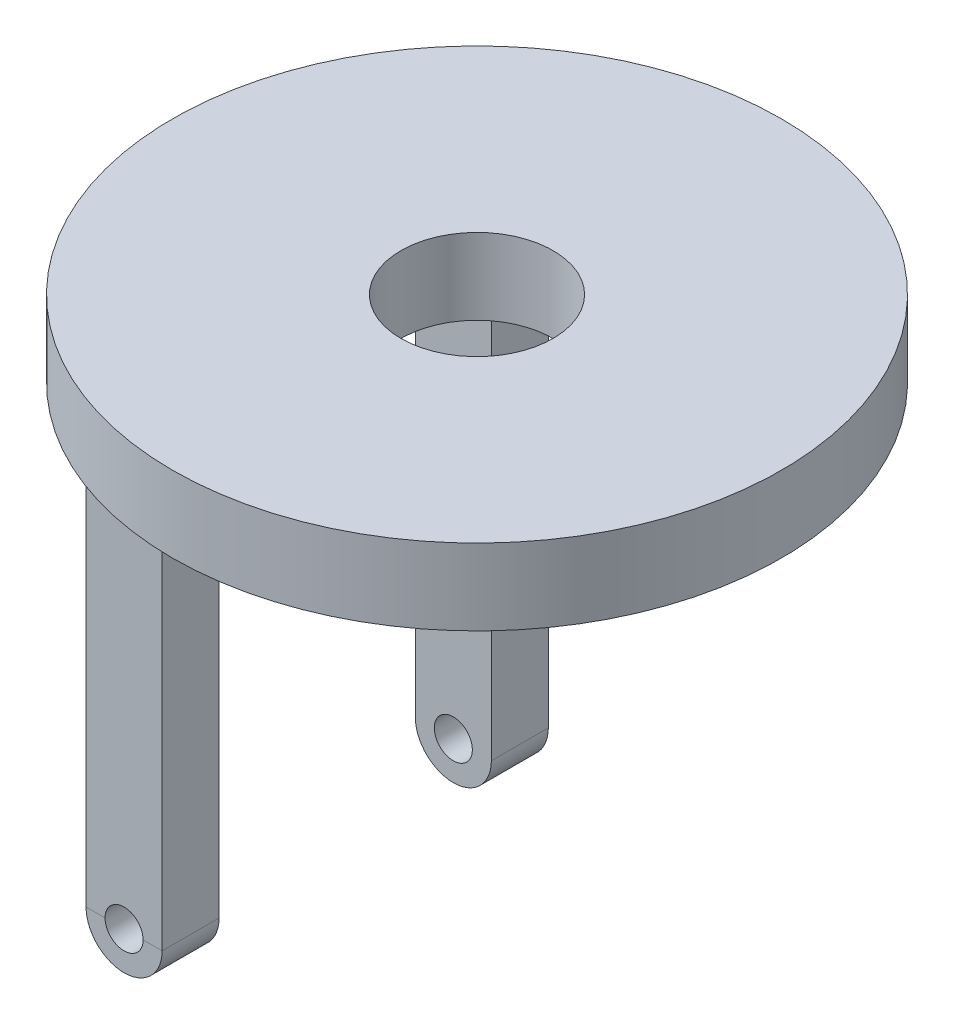
ISO-10303-21;
HEADER;
FILE_DESCRIPTION(('STEP AP214'),'2;1');
FILE_NAME('part.step','',(''),(''),'','','');
FILE_SCHEMA(('AUTOMOTIVE_DESIGN { 1 0 10303 214 1 1 1 1 }'));
ENDSEC;
DATA;
#1=APPLICATION_CONTEXT('core data for automotive mechanical design processes');
#2=APPLICATION_PROTOCOL_DEFINITION('international standard','automotive_design',2000,#1);
#3=PRODUCT_CONTEXT('',#1,'mechanical');
#4=PRODUCT('Part','Part','',(#3));
#5=PRODUCT_RELATED_PRODUCT_CATEGORY('part','',(#4));
#6=PRODUCT_DEFINITION_FORMATION('','',#4);
#7=PRODUCT_DEFINITION_CONTEXT('part definition',#1,'design');
#8=PRODUCT_DEFINITION('design','',#6,#7);
#9=PRODUCT_DEFINITION_SHAPE('','',#8);
#10=(LENGTH_UNIT() NAMED_UNIT(*) SI_UNIT(.MILLI.,.METRE.));
#11=(NAMED_UNIT(*) PLANE_ANGLE_UNIT() SI_UNIT($,.RADIAN.));
#12=(NAMED_UNIT(*) SI_UNIT($,.STERADIAN.) SOLID_ANGLE_UNIT());
#13=UNCERTAINTY_MEASURE_WITH_UNIT(LENGTH_MEASURE(1.E-05),#10,'distance_accuracy_value','');
#14=(GEOMETRIC_REPRESENTATION_CONTEXT(3) GLOBAL_UNCERTAINTY_ASSIGNED_CONTEXT((#13)) GLOBAL_UNIT_ASSIGNED_CONTEXT((#10,
#11,#12)) REPRESENTATION_CONTEXT('',''));
#15=CARTESIAN_POINT('',(0.,0.,0.));
#16=DIRECTION('',(0.,0.,1.));
#17=DIRECTION('',(1.,0.,0.));
#18=AXIS2_PLACEMENT_3D('',#15,#16,#17);
#19=CARTESIAN_POINT('',(-10.5,-16.25,-12.6842719099992));
#20=DIRECTION('',(0.,0.,1.));
#21=DIRECTION('',(1.,0.,0.));
#22=AXIS2_PLACEMENT_3D('',#19,#20,#21);
#23=PLANE('',#22);
#24=CARTESIAN_POINT('',(-11.75,-30.,-12.6885775404495));
#25=DIRECTION('',(-0.999999992847485,0.0001196036362698,0.));
#26=VECTOR('',#25,1.);
#27=LINE('',#24,#26);
#28=CARTESIAN_POINT('',(-11.75,-30.,-12.6865784977404));
#29=VERTEX_POINT('',#28);
#30=CARTESIAN_POINT('',(-13.0000000055106,-29.9998504954527,-12.6865697759956));
#31=VERTEX_POINT('',#30);
#32=EDGE_CURVE('E128',#29,#31,#27,.T.);
#33=ORIENTED_EDGE('',*,*,#32,.F.);
#34=CARTESIAN_POINT('',(-10.5,-30.,-12.6842719099992));
#35=DIRECTION('',(0.,0.,1.));
#36=DIRECTION('',(1.,0.,0.));
#37=AXIS2_PLACEMENT_3D('',#34,#35,#36);
#38=CIRCLE('',#37,1.25);
#39=CARTESIAN_POINT('',(-9.25,-30.,-12.6865784977404));
#40=VERTEX_POINT('',#39);
#41=EDGE_CURVE('E122',#29,#40,#38,.T.);
#42=ORIENTED_EDGE('',*,*,#41,.T.);
#43=CARTESIAN_POINT('',(-7.99999999254963,-30.0001495045472,-12.6885775404495));
#44=DIRECTION('',(-0.999999992847485,0.000119603636192084,0.));
#45=VECTOR('',#44,1.);
#46=LINE('',#43,#45);
#47=CARTESIAN_POINT('',(-7.99999999573109,-30.0001495045469,-12.6865697759956));
#48=VERTEX_POINT('',#47);
#49=EDGE_CURVE('E120',#48,#40,#46,.T.);
#50=ORIENTED_EDGE('',*,*,#49,.F.);
#51=CARTESIAN_POINT('',(-10.5,-30.,-12.6842719099992));
#52=DIRECTION('',(0.,0.,1.));
#53=DIRECTION('',(1.,0.,0.));
#54=AXIS2_PLACEMENT_3D('',#51,#52,#53);
#55=CIRCLE('',#54,2.5);
#56=EDGE_CURVE('E110',#31,#48,#55,.T.);
#57=ORIENTED_EDGE('',*,*,#56,.F.);
#58=EDGE_LOOP('',(#33,#42,#50,#57));
#59=FACE_BOUND('',#58,.T.);
#60=ADVANCED_FACE('F17',(#59),#23,.F.);
#61=CARTESIAN_POINT('',(-10.5,-16.25,12.6842719099992));
#62=DIRECTION('',(0.,0.,-1.));
#63=DIRECTION('',(-1.,0.,0.));
#64=AXIS2_PLACEMENT_3D('',#61,#62,#63);
#65=PLANE('',#64);
#66=CARTESIAN_POINT('',(-13.0000000074504,-30.0001495045473,12.6885775404495));
#67=DIRECTION('',(0.999999992847485,0.000119603636272574,0.));
#68=VECTOR('',#67,1.);
#69=LINE('',#66,#68);
#70=CARTESIAN_POINT('',(-13.0000000053452,-30.0001495045471,12.6864793282527));
#71=VERTEX_POINT('',#70);
#72=CARTESIAN_POINT('',(-11.75,-30.,12.6864247252243));
#73=VERTEX_POINT('',#72);
#74=EDGE_CURVE('E118',#71,#73,#69,.T.);
#75=ORIENTED_EDGE('',*,*,#74,.F.);
#76=CARTESIAN_POINT('',(-10.5,-30.,12.6842719099992));
#77=DIRECTION('',(0.,0.,-1.));
#78=DIRECTION('',(-1.,0.,0.));
#79=AXIS2_PLACEMENT_3D('',#76,#77,#78);
#80=CIRCLE('',#79,2.5);
#81=CARTESIAN_POINT('',(-7.99999999465044,-29.999850495453,12.6865697759955));
#82=VERTEX_POINT('',#81);
#83=EDGE_CURVE('E165',#82,#71,#80,.T.);
#84=ORIENTED_EDGE('',*,*,#83,.F.);
#85=CARTESIAN_POINT('',(-9.25,-30.,12.6885775404495));
#86=DIRECTION('',(0.999999992847485,0.000119603636069959,0.));
#87=VECTOR('',#86,1.);
#88=LINE('',#85,#87);
#89=CARTESIAN_POINT('',(-9.25,-30.,12.6864247252243));
#90=VERTEX_POINT('',#89);
#91=EDGE_CURVE('E94',#90,#82,#88,.T.);
#92=ORIENTED_EDGE('',*,*,#91,.F.);
#93=CARTESIAN_POINT('',(-10.5,-30.,12.6842719099992));
#94=DIRECTION('',(0.,0.,-1.));
#95=DIRECTION('',(-1.,0.,0.));
#96=AXIS2_PLACEMENT_3D('',#93,#94,#95);
#97=CIRCLE('',#96,1.25);
#98=EDGE_CURVE('E169',#90,#73,#97,.T.);
#99=ORIENTED_EDGE('',*,*,#98,.T.);
#100=EDGE_LOOP('',(#75,#84,#92,#99));
#101=FACE_BOUND('',#100,.T.);
#102=ADVANCED_FACE('F182',(#101),#65,.F.);
#103=CARTESIAN_POINT('',(-10.5,-30.,-12.6842719099992));
#104=DIRECTION('',(0.,0.,1.));
#105=DIRECTION('',(1.,0.,0.));
#106=AXIS2_PLACEMENT_3D('',#103,#104,#105);
#107=CYLINDRICAL_SURFACE('',#106,2.5);
#108=CARTESIAN_POINT('',(-10.5,-30.,-8.94427190999915));
#109=DIRECTION('',(0.,0.,1.));
#110=DIRECTION('',(1.,0.,0.));
#111=AXIS2_PLACEMENT_3D('',#108,#109,#110);
#112=CIRCLE('',#111,2.5);
#113=CARTESIAN_POINT('',(-13.,-30.,-8.94427190999915));
#114=VERTEX_POINT('',#113);
#115=CARTESIAN_POINT('',(-8.,-30.,-8.94427190999915));
#116=VERTEX_POINT('',#115);
#117=EDGE_CURVE('E159',#114,#116,#112,.T.);
#118=ORIENTED_EDGE('',*,*,#117,.F.);
#119=DIRECTION('',(0.,-3.99529765152787E-05,0.99999999920188));
#120=VECTOR('',#119,1.);
#121=CARTESIAN_POINT('',(-13.,-29.9998504954527,-12.6862846514323));
#122=LINE('',#121,#120);
#123=EDGE_CURVE('E114',#31,#114,#122,.T.);
#124=ORIENTED_EDGE('',*,*,#123,.F.);
#125=ORIENTED_EDGE('',*,*,#56,.T.);
#126=DIRECTION('',(0.,-3.99529764893174E-05,-0.99999999920188));
#127=VECTOR('',#126,1.);
#128=CARTESIAN_POINT('',(-8.,-30.,-8.94427190999915));
#129=LINE('',#128,#127);
#130=EDGE_CURVE('E85',#116,#48,#129,.T.);
#131=ORIENTED_EDGE('',*,*,#130,.F.);
#132=EDGE_LOOP('',(#118,#124,#125,#131));
#133=FACE_BOUND('',#132,.T.);
#134=ADVANCED_FACE('F112',(#133),#107,.T.);
#135=CARTESIAN_POINT('',(-8.,-30.,-10.8164247252243));
#136=DIRECTION('',(1.,0.,0.));
#137=DIRECTION('',(0.,0.,-1.));
#138=AXIS2_PLACEMENT_3D('',#135,#136,#137);
#139=PLANE('',#138);
#140=ORIENTED_EDGE('',*,*,#130,.T.);
#141=DIRECTION('',(0.,1.,0.));
#142=VECTOR('',#141,1.);
#143=CARTESIAN_POINT('',(-8.,-30.,-12.6885775404495));
#144=LINE('',#143,#142);
#145=CARTESIAN_POINT('',(-8.,-1.,-12.6885775404495));
#146=VERTEX_POINT('',#145);
#147=EDGE_CURVE('E134',#146,#48,#144,.F.);
#148=ORIENTED_EDGE('',*,*,#147,.F.);
#149=DIRECTION('',(0.,0.,-1.));
#150=VECTOR('',#149,1.);
#151=CARTESIAN_POINT('',(-8.,-1.,0.));
#152=LINE('',#151,#150);
#153=CARTESIAN_POINT('',(-8.,-1.,-8.94427190999916));
#154=VERTEX_POINT('',#153);
#155=EDGE_CURVE('E233',#154,#146,#152,.T.);
#156=ORIENTED_EDGE('',*,*,#155,.F.);
#157=DIRECTION('',(0.,1.,0.));
#158=VECTOR('',#157,1.);
#159=CARTESIAN_POINT('',(-8.,-30.,-8.94427190999915));
#160=LINE('',#159,#158);
#161=EDGE_CURVE('E137',#116,#154,#160,.T.);
#162=ORIENTED_EDGE('',*,*,#161,.F.);
#163=EDGE_LOOP('',(#140,#148,#156,#162));
#164=FACE_BOUND('',#163,.T.);
#165=ADVANCED_FACE('F133',(#164),#139,.T.);
#166=CARTESIAN_POINT('',(-10.5,-30.,-37.3157280900008));
#167=DIRECTION('',(0.,0.,1.));
#168=DIRECTION('',(1.,0.,0.));
#169=AXIS2_PLACEMENT_3D('',#166,#167,#168);
#170=CYLINDRICAL_SURFACE('',#169,1.25);
#171=ORIENTED_EDGE('',*,*,#41,.F.);
#172=CARTESIAN_POINT('',(-10.5,-30.,-12.6885775404495));
#173=DIRECTION('',(0.,0.,-1.));
#174=DIRECTION('',(-1.,0.,0.));
#175=AXIS2_PLACEMENT_3D('',#172,#173,#174);
#176=CIRCLE('',#175,1.25);
#177=EDGE_CURVE('E145',#40,#29,#176,.F.);
#178=ORIENTED_EDGE('',*,*,#177,.F.);
#179=EDGE_LOOP('',(#171,#178));
#180=FACE_BOUND('',#179,.T.);
#181=CARTESIAN_POINT('',(-10.5,-30.,-8.94427190999916));
#182=DIRECTION('',(0.,0.,1.));
#183=DIRECTION('',(1.,0.,0.));
#184=AXIS2_PLACEMENT_3D('',#181,#182,#183);
#185=CIRCLE('',#184,1.25);
#186=CARTESIAN_POINT('',(-9.25,-30.,-8.94427190999916));
#187=VERTEX_POINT('',#186);
#188=EDGE_CURVE('E161',#187,#187,#185,.F.);
#189=ORIENTED_EDGE('',*,*,#188,.F.);
#190=EDGE_LOOP('',(#189));
#191=FACE_BOUND('',#190,.T.);
#192=ADVANCED_FACE('F260',(#180,#191),#170,.F.);
#193=CARTESIAN_POINT('',(-10.5,-30.,-37.3157280900008));
#194=DIRECTION('',(0.,0.,1.));
#195=DIRECTION('',(1.,0.,0.));
#196=AXIS2_PLACEMENT_3D('',#193,#194,#195);
#197=CYLINDRICAL_SURFACE('',#196,1.25);
#198=CARTESIAN_POINT('',(-10.5,-30.,8.94427190999916));
#199=DIRECTION('',(0.,0.,1.));
#200=DIRECTION('',(1.,0.,0.));
#201=AXIS2_PLACEMENT_3D('',#198,#199,#200);
#202=CIRCLE('',#201,1.25);
#203=CARTESIAN_POINT('',(-9.25,-30.,8.94427190999916));
#204=VERTEX_POINT('',#203);
#205=EDGE_CURVE('E385',#204,#204,#202,.T.);
#206=ORIENTED_EDGE('',*,*,#205,.F.);
#207=EDGE_LOOP('',(#206));
#208=FACE_BOUND('',#207,.T.);
#209=CARTESIAN_POINT('',(-10.5,-30.,12.6885775404495));
#210=DIRECTION('',(0.,0.,1.));
#211=DIRECTION('',(1.,0.,0.));
#212=AXIS2_PLACEMENT_3D('',#209,#210,#211);
#213=CIRCLE('',#212,1.25);
#214=EDGE_CURVE('E190',#73,#90,#213,.F.);
#215=ORIENTED_EDGE('',*,*,#214,.F.);
#216=ORIENTED_EDGE('',*,*,#98,.F.);
#217=EDGE_LOOP('',(#215,#216));
#218=FACE_BOUND('',#217,.T.);
#219=ADVANCED_FACE('F196',(#208,#218),#197,.F.);
#220=CARTESIAN_POINT('',(-8.,-30.,10.8164247252243));
#221=DIRECTION('',(-1.,0.,0.));
#222=DIRECTION('',(0.,0.,1.));
#223=AXIS2_PLACEMENT_3D('',#220,#221,#222);
#224=PLANE('',#223);
#225=DIRECTION('',(0.,0.,-1.));
#226=VECTOR('',#225,1.);
#227=CARTESIAN_POINT('',(-8.,-1.,0.));
#228=LINE('',#227,#226);
#229=CARTESIAN_POINT('',(-7.99999999627482,-1.,12.6885775404495));
#230=VERTEX_POINT('',#229);
#231=CARTESIAN_POINT('',(-8.,-1.,8.94427190999916));
#232=VERTEX_POINT('',#231);
#233=EDGE_CURVE('E164',#230,#232,#228,.T.);
#234=ORIENTED_EDGE('',*,*,#233,.F.);
#235=DIRECTION('',(0.,1.,0.));
#236=VECTOR('',#235,1.);
#237=CARTESIAN_POINT('',(-7.99999999254963,-30.,12.6885775404495));
#238=LINE('',#237,#236);
#239=EDGE_CURVE('E202',#82,#230,#238,.T.);
#240=ORIENTED_EDGE('',*,*,#239,.F.);
#241=CARTESIAN_POINT('',(-8.,-30.,8.94427190999916));
#242=CARTESIAN_POINT('',(-8.,-29.9999937706439,9.10018910755888));
#243=CARTESIAN_POINT('',(-8.00000000002328,-29.9999875412878,9.2561063051186));
#244=CARTESIAN_POINT('',(-8.00000000011642,-29.9999750825756,9.56794070023805));
#245=CARTESIAN_POINT('',(-8.00000000018627,-29.9999688532195,9.72385789779777));
#246=CARTESIAN_POINT('',(-8.00000000037253,-29.9999563945073,10.0356922929172));
#247=CARTESIAN_POINT('',(-8.00000000048894,-29.9999501651512,10.1916094904769));
#248=CARTESIAN_POINT('',(-8.00000000076834,-29.999937706439,10.5034438855964));
#249=CARTESIAN_POINT('',(-8.00000000093132,-29.9999314770829,10.6593610831561));
#250=CARTESIAN_POINT('',(-8.00000000130384,-29.9999190183707,10.9711954782756));
#251=CARTESIAN_POINT('',(-8.00000000151339,-29.9999127890146,11.1271126758353));
#252=CARTESIAN_POINT('',(-8.00000000197905,-29.9999003303024,11.4389470709547));
#253=CARTESIAN_POINT('',(-8.00000000223516,-29.9998941009463,11.5948642685144));
#254=CARTESIAN_POINT('',(-8.00000000279395,-29.9998816422341,11.9066986636339));
#255=CARTESIAN_POINT('',(-8.00000000309663,-29.999875412878,12.0626158611936));
#256=CARTESIAN_POINT('',(-8.00000000374855,-29.9998629541658,12.3744502563131));
#257=CARTESIAN_POINT('',(-8.0000000040978,-29.9998567248098,12.5303674538728));
#258=CARTESIAN_POINT('',(-8.00000000447032,-29.9998504954537,12.6862846514325));
#259=B_SPLINE_CURVE_WITH_KNOTS('',3,(#241,#242,#243,#244,#245,#246,#247,#248,#249,#250,#251,
#252,#253,#254,#255,#256,#257,#258),.UNSPECIFIED.,.F.,.F.,(4,2,2,2,2,2,2,2,4),(0.,
0.46775159305249,0.935503186104979,1.40325477915747,1.87100637220996,2.33875796526245,
2.80650955831494,3.27426115136743,3.74201274441992),.UNSPECIFIED.);
#260=CARTESIAN_POINT('',(-8.,-30.,8.94427190999916));
#261=VERTEX_POINT('',#260);
#262=EDGE_CURVE('E168',#261,#82,#259,.T.);
#263=ORIENTED_EDGE('',*,*,#262,.F.);
#264=DIRECTION('',(0.,1.,0.));
#265=VECTOR('',#264,1.);
#266=CARTESIAN_POINT('',(-8.,-30.,8.94427190999916));
#267=LINE('',#266,#265);
#268=EDGE_CURVE('E386',#232,#261,#267,.F.);
#269=ORIENTED_EDGE('',*,*,#268,.F.);
#270=EDGE_LOOP('',(#234,#240,#263,#269));
#271=FACE_BOUND('',#270,.T.);
#272=ADVANCED_FACE('F252',(#271),#224,.F.);
#273=CARTESIAN_POINT('',(-10.5,-30.,12.6842719099992));
#274=DIRECTION('',(0.,0.,-1.));
#275=DIRECTION('',(-1.,0.,0.));
#276=AXIS2_PLACEMENT_3D('',#273,#274,#275);
#277=CYLINDRICAL_SURFACE('',#276,2.5);
#278=CARTESIAN_POINT('',(-10.5,-30.,8.94427190999916));
#279=DIRECTION('',(0.,0.,-1.));
#280=DIRECTION('',(-1.,0.,0.));
#281=AXIS2_PLACEMENT_3D('',#278,#279,#280);
#282=CIRCLE('',#281,2.5);
#283=CARTESIAN_POINT('',(-13.,-30.,8.94427190999916));
#284=VERTEX_POINT('',#283);
#285=EDGE_CURVE('E389',#261,#284,#282,.T.);
#286=ORIENTED_EDGE('',*,*,#285,.F.);
#287=ORIENTED_EDGE('',*,*,#262,.T.);
#288=ORIENTED_EDGE('',*,*,#83,.T.);
#289=DIRECTION('',(0.,-3.99529765162057E-05,0.99999999920188));
#290=VECTOR('',#289,1.);
#291=CARTESIAN_POINT('',(-13.,-30.,8.94427190999916));
#292=LINE('',#291,#290);
#293=EDGE_CURVE('E197',#284,#71,#292,.T.);
#294=ORIENTED_EDGE('',*,*,#293,.F.);
#295=EDGE_LOOP('',(#286,#287,#288,#294));
#296=FACE_BOUND('',#295,.T.);
#297=ADVANCED_FACE('F241',(#296),#277,.T.);
#298=CARTESIAN_POINT('',(0.,-1.,0.));
#299=DIRECTION('',(0.,-1.,0.));
#300=DIRECTION('',(0.,0.,-1.));
#301=AXIS2_PLACEMENT_3D('',#298,#299,#300);
#302=PLANE('',#301);
#303=ORIENTED_EDGE('',*,*,#233,.T.);
#304=CARTESIAN_POINT('',(0.,-1.,0.));
#305=DIRECTION('',(0.,1.,0.));
#306=DIRECTION('',(0.,0.,1.));
#307=AXIS2_PLACEMENT_3D('',#304,#305,#306);
#308=CIRCLE('',#307,12.);
#309=EDGE_CURVE('E395',#232,#154,#308,.T.);
#310=ORIENTED_EDGE('',*,*,#309,.T.);
#311=ORIENTED_EDGE('',*,*,#155,.T.);
#312=CARTESIAN_POINT('',(0.,-1.,0.));
#313=DIRECTION('',(0.,1.,0.));
#314=DIRECTION('',(0.,0.,1.));
#315=AXIS2_PLACEMENT_3D('',#312,#313,#314);
#316=CIRCLE('',#315,15.);
#317=EDGE_CURVE('E211',#230,#146,#316,.T.);
#318=ORIENTED_EDGE('',*,*,#317,.F.);
#319=EDGE_LOOP('',(#303,#310,#311,#318));
#320=FACE_BOUND('',#319,.T.);
#321=ADVANCED_FACE('F251',(#320),#302,.T.);
#322=CARTESIAN_POINT('',(-10.5,-30.,-8.94427190999915));
#323=DIRECTION('',(0.,0.,1.));
#324=DIRECTION('',(1.,0.,0.));
#325=AXIS2_PLACEMENT_3D('',#322,#323,#324);
#326=PLANE('',#325);
#327=DIRECTION('',(0.,1.,0.));
#328=VECTOR('',#327,1.);
#329=CARTESIAN_POINT('',(-8.,-1.,-8.94427190999916));
#330=LINE('',#329,#328);
#331=CARTESIAN_POINT('',(-8.00000000000001,0.,-8.94427190999916));
#332=VERTEX_POINT('',#331);
#333=EDGE_CURVE('E398',#154,#332,#330,.T.);
#334=ORIENTED_EDGE('',*,*,#333,.T.);
#335=DIRECTION('',(1.,0.,0.));
#336=VECTOR('',#335,1.);
#337=CARTESIAN_POINT('',(0.,0.,-8.94427190999915));
#338=LINE('',#337,#336);
#339=CARTESIAN_POINT('',(-13.,0.,-8.94427190999915));
#340=VERTEX_POINT('',#339);
#341=EDGE_CURVE('E223',#332,#340,#338,.F.);
#342=ORIENTED_EDGE('',*,*,#341,.T.);
#343=DIRECTION('',(0.,1.,0.));
#344=VECTOR('',#343,1.);
#345=CARTESIAN_POINT('',(-13.,-30.,-8.94427190999915));
#346=LINE('',#345,#344);
#347=EDGE_CURVE('E150',#114,#340,#346,.T.);
#348=ORIENTED_EDGE('',*,*,#347,.F.);
#349=ORIENTED_EDGE('',*,*,#117,.T.);
#350=ORIENTED_EDGE('',*,*,#161,.T.);
#351=EDGE_LOOP('',(#334,#342,#348,#349,#350));
#352=FACE_BOUND('',#351,.T.);
#353=ORIENTED_EDGE('',*,*,#188,.T.);
#354=EDGE_LOOP('',(#353));
#355=FACE_BOUND('',#354,.T.);
#356=ADVANCED_FACE('F337',(#352,#355),#326,.T.);
#357=CARTESIAN_POINT('',(-13.,-30.,-10.8164247252243));
#358=DIRECTION('',(-1.,0.,0.));
#359=DIRECTION('',(0.,0.,1.));
#360=AXIS2_PLACEMENT_3D('',#357,#358,#359);
#361=PLANE('',#360);
#362=ORIENTED_EDGE('',*,*,#123,.T.);
#363=ORIENTED_EDGE('',*,*,#347,.T.);
#364=DIRECTION('',(0.,0.,1.));
#365=VECTOR('',#364,1.);
#366=CARTESIAN_POINT('',(-13.,0.,0.));
#367=LINE('',#366,#365);
#368=CARTESIAN_POINT('',(-13.0000000037252,0.,-12.6885775404495));
#369=VERTEX_POINT('',#368);
#370=EDGE_CURVE('E220',#340,#369,#367,.F.);
#371=ORIENTED_EDGE('',*,*,#370,.T.);
#372=DIRECTION('',(0.,1.,0.));
#373=VECTOR('',#372,1.);
#374=CARTESIAN_POINT('',(-13.0000000074504,-30.,-12.6885775404495));
#375=LINE('',#374,#373);
#376=EDGE_CURVE('E146',#31,#369,#375,.T.);
#377=ORIENTED_EDGE('',*,*,#376,.F.);
#378=EDGE_LOOP('',(#362,#363,#371,#377));
#379=FACE_BOUND('',#378,.T.);
#380=ADVANCED_FACE('F312',(#379),#361,.T.);
#381=CARTESIAN_POINT('',(-10.5,-30.,-12.6885775404495));
#382=DIRECTION('',(0.,0.,-1.));
#383=DIRECTION('',(-1.,0.,0.));
#384=AXIS2_PLACEMENT_3D('',#381,#382,#383);
#385=PLANE('',#384);
#386=ORIENTED_EDGE('',*,*,#49,.T.);
#387=ORIENTED_EDGE('',*,*,#177,.T.);
#388=ORIENTED_EDGE('',*,*,#32,.T.);
#389=ORIENTED_EDGE('',*,*,#376,.T.);
#390=DIRECTION('',(1.,0.,0.));
#391=VECTOR('',#390,1.);
#392=CARTESIAN_POINT('',(0.,0.,-12.6885775404495));
#393=LINE('',#392,#391);
#394=CARTESIAN_POINT('',(-7.99999999999999,0.,-12.6885775404495));
#395=VERTEX_POINT('',#394);
#396=EDGE_CURVE('E222',#369,#395,#393,.T.);
#397=ORIENTED_EDGE('',*,*,#396,.T.);
#398=DIRECTION('',(0.,1.,0.));
#399=VECTOR('',#398,1.);
#400=CARTESIAN_POINT('',(-7.99999999999999,-1.,-12.6885775404495));
#401=LINE('',#400,#399);
#402=EDGE_CURVE('E144',#146,#395,#401,.T.);
#403=ORIENTED_EDGE('',*,*,#402,.F.);
#404=ORIENTED_EDGE('',*,*,#147,.T.);
#405=EDGE_LOOP('',(#386,#387,#388,#389,#397,#403,#404));
#406=FACE_BOUND('',#405,.T.);
#407=ADVANCED_FACE('F141',(#406),#385,.T.);
#408=CARTESIAN_POINT('',(0.,-1.,0.));
#409=DIRECTION('',(0.,1.,0.));
#410=DIRECTION('',(0.,0.,1.));
#411=AXIS2_PLACEMENT_3D('',#408,#409,#410);
#412=CYLINDRICAL_SURFACE('',#411,15.);
#413=CARTESIAN_POINT('',(0.,0.,0.));
#414=DIRECTION('',(0.,1.,0.));
#415=DIRECTION('',(0.,0.,1.));
#416=AXIS2_PLACEMENT_3D('',#413,#414,#415);
#417=CIRCLE('',#416,15.);
#418=CARTESIAN_POINT('',(-8.,0.,12.6885775404495));
#419=VERTEX_POINT('',#418);
#420=EDGE_CURVE('E399',#395,#419,#417,.F.);
#421=ORIENTED_EDGE('',*,*,#420,.T.);
#422=DIRECTION('',(0.,1.,0.));
#423=VECTOR('',#422,1.);
#424=CARTESIAN_POINT('',(-8.,-30.,12.6885775404495));
#425=LINE('',#424,#423);
#426=EDGE_CURVE('E198',#230,#419,#425,.T.);
#427=ORIENTED_EDGE('',*,*,#426,.F.);
#428=ORIENTED_EDGE('',*,*,#317,.T.);
#429=ORIENTED_EDGE('',*,*,#402,.T.);
#430=EDGE_LOOP('',(#421,#427,#428,#429));
#431=FACE_BOUND('',#430,.T.);
#432=ADVANCED_FACE('F297',(#431),#412,.T.);
#433=CARTESIAN_POINT('',(-10.5,-30.,12.6885775404495));
#434=DIRECTION('',(0.,0.,1.));
#435=DIRECTION('',(1.,0.,0.));
#436=AXIS2_PLACEMENT_3D('',#433,#434,#435);
#437=PLANE('',#436);
#438=ORIENTED_EDGE('',*,*,#74,.T.);
#439=ORIENTED_EDGE('',*,*,#214,.T.);
#440=ORIENTED_EDGE('',*,*,#91,.T.);
#441=ORIENTED_EDGE('',*,*,#239,.T.);
#442=ORIENTED_EDGE('',*,*,#426,.T.);
#443=DIRECTION('',(1.,0.,0.));
#444=VECTOR('',#443,1.);
#445=CARTESIAN_POINT('',(0.,0.,12.6885775404495));
#446=LINE('',#445,#444);
#447=CARTESIAN_POINT('',(-13.,0.,12.6885775404495));
#448=VERTEX_POINT('',#447);
#449=EDGE_CURVE('E401',#419,#448,#446,.F.);
#450=ORIENTED_EDGE('',*,*,#449,.T.);
#451=DIRECTION('',(0.,1.,0.));
#452=VECTOR('',#451,1.);
#453=CARTESIAN_POINT('',(-13.,-30.,12.6885775404495));
#454=LINE('',#453,#452);
#455=EDGE_CURVE('E192',#71,#448,#454,.T.);
#456=ORIENTED_EDGE('',*,*,#455,.F.);
#457=EDGE_LOOP('',(#438,#439,#440,#441,#442,#450,#456));
#458=FACE_BOUND('',#457,.T.);
#459=ADVANCED_FACE('F189',(#458),#437,.T.);
#460=CARTESIAN_POINT('',(-13.,-30.,10.8164247252243));
#461=DIRECTION('',(-1.,0.,0.));
#462=DIRECTION('',(0.,0.,1.));
#463=AXIS2_PLACEMENT_3D('',#460,#461,#462);
#464=PLANE('',#463);
#465=ORIENTED_EDGE('',*,*,#293,.T.);
#466=ORIENTED_EDGE('',*,*,#455,.T.);
#467=DIRECTION('',(0.,0.,1.));
#468=VECTOR('',#467,1.);
#469=CARTESIAN_POINT('',(-13.,0.,0.));
#470=LINE('',#469,#468);
#471=CARTESIAN_POINT('',(-13.,0.,8.94427190999916));
#472=VERTEX_POINT('',#471);
#473=EDGE_CURVE('E425',#448,#472,#470,.F.);
#474=ORIENTED_EDGE('',*,*,#473,.T.);
#475=DIRECTION('',(0.,1.,0.));
#476=VECTOR('',#475,1.);
#477=CARTESIAN_POINT('',(-13.,-30.,8.94427190999916));
#478=LINE('',#477,#476);
#479=EDGE_CURVE('E394',#284,#472,#478,.T.);
#480=ORIENTED_EDGE('',*,*,#479,.F.);
#481=EDGE_LOOP('',(#465,#466,#474,#480));
#482=FACE_BOUND('',#481,.T.);
#483=ADVANCED_FACE('F296',(#482),#464,.T.);
#484=CARTESIAN_POINT('',(-10.5,-30.,8.94427190999916));
#485=DIRECTION('',(0.,0.,-1.));
#486=DIRECTION('',(-1.,0.,0.));
#487=AXIS2_PLACEMENT_3D('',#484,#485,#486);
#488=PLANE('',#487);
#489=DIRECTION('',(1.,0.,0.));
#490=VECTOR('',#489,1.);
#491=CARTESIAN_POINT('',(0.,0.,8.94427190999916));
#492=LINE('',#491,#490);
#493=CARTESIAN_POINT('',(-8.,0.,8.94427190999916));
#494=VERTEX_POINT('',#493);
#495=EDGE_CURVE('E381',#472,#494,#492,.T.);
#496=ORIENTED_EDGE('',*,*,#495,.T.);
#497=DIRECTION('',(0.,1.,0.));
#498=VECTOR('',#497,1.);
#499=CARTESIAN_POINT('',(-8.00000000000001,-1.,8.94427190999915));
#500=LINE('',#499,#498);
#501=EDGE_CURVE('E438',#494,#232,#500,.F.);
#502=ORIENTED_EDGE('',*,*,#501,.T.);
#503=ORIENTED_EDGE('',*,*,#268,.T.);
#504=ORIENTED_EDGE('',*,*,#285,.T.);
#505=ORIENTED_EDGE('',*,*,#479,.T.);
#506=EDGE_LOOP('',(#496,#502,#503,#504,#505));
#507=FACE_BOUND('',#506,.T.);
#508=ORIENTED_EDGE('',*,*,#205,.T.);
#509=EDGE_LOOP('',(#508));
#510=FACE_BOUND('',#509,.T.);
#511=ADVANCED_FACE('F370',(#507,#510),#488,.T.);
#512=CARTESIAN_POINT('',(0.,-1.,0.));
#513=DIRECTION('',(0.,1.,0.));
#514=DIRECTION('',(0.,0.,1.));
#515=AXIS2_PLACEMENT_3D('',#512,#513,#514);
#516=CYLINDRICAL_SURFACE('',#515,12.);
#517=ORIENTED_EDGE('',*,*,#309,.F.);
#518=ORIENTED_EDGE('',*,*,#501,.F.);
#519=CARTESIAN_POINT('',(0.,0.,0.));
#520=DIRECTION('',(0.,1.,0.));
#521=DIRECTION('',(0.,0.,1.));
#522=AXIS2_PLACEMENT_3D('',#519,#520,#521);
#523=CIRCLE('',#522,12.);
#524=EDGE_CURVE('E36',#494,#332,#523,.T.);
#525=ORIENTED_EDGE('',*,*,#524,.T.);
#526=ORIENTED_EDGE('',*,*,#333,.F.);
#527=EDGE_LOOP('',(#517,#518,#525,#526));
#528=FACE_BOUND('',#527,.T.);
#529=ADVANCED_FACE('F367',(#528),#516,.F.);
#530=CARTESIAN_POINT('',(0.,0.,0.));
#531=DIRECTION('',(0.,1.,0.));
#532=DIRECTION('',(0.,0.,1.));
#533=AXIS2_PLACEMENT_3D('',#530,#531,#532);
#534=PLANE('',#533);
#535=CARTESIAN_POINT('',(0.,0.,0.));
#536=DIRECTION('',(0.,-1.,0.));
#537=DIRECTION('',(0.,0.,-1.));
#538=AXIS2_PLACEMENT_3D('',#535,#536,#537);
#539=CIRCLE('',#538,20.);
#540=CARTESIAN_POINT('',(0.,0.,-20.));
#541=VERTEX_POINT('',#540);
#542=EDGE_CURVE('E406',#541,#541,#539,.F.);
#543=ORIENTED_EDGE('',*,*,#542,.F.);
#544=EDGE_LOOP('',(#543));
#545=FACE_BOUND('',#544,.T.);
#546=ORIENTED_EDGE('',*,*,#524,.F.);
#547=ORIENTED_EDGE('',*,*,#495,.F.);
#548=ORIENTED_EDGE('',*,*,#473,.F.);
#549=ORIENTED_EDGE('',*,*,#449,.F.);
#550=ORIENTED_EDGE('',*,*,#420,.F.);
#551=ORIENTED_EDGE('',*,*,#396,.F.);
#552=ORIENTED_EDGE('',*,*,#370,.F.);
#553=ORIENTED_EDGE('',*,*,#341,.F.);
#554=EDGE_LOOP('',(#546,#547,#548,#549,#550,#551,#552,#553));
#555=FACE_BOUND('',#554,.T.);
#556=CARTESIAN_POINT('',(0.,0.,0.));
#557=DIRECTION('',(0.,1.,0.));
#558=DIRECTION('',(0.,0.,1.));
#559=AXIS2_PLACEMENT_3D('',#556,#557,#558);
#560=CIRCLE('',#559,5.);
#561=CARTESIAN_POINT('',(0.,0.,5.));
#562=VERTEX_POINT('',#561);
#563=EDGE_CURVE('E403',#562,#562,#560,.T.);
#564=ORIENTED_EDGE('',*,*,#563,.T.);
#565=EDGE_LOOP('',(#564));
#566=FACE_BOUND('',#565,.T.);
#567=ADVANCED_FACE('F363',(#545,#555,#566),#534,.F.);
#568=CARTESIAN_POINT('',(0.,0.,0.));
#569=DIRECTION('',(0.,1.,0.));
#570=DIRECTION('',(0.,0.,1.));
#571=AXIS2_PLACEMENT_3D('',#568,#569,#570);
#572=CYLINDRICAL_SURFACE('',#571,5.);
#573=CARTESIAN_POINT('',(0.,5.,0.));
#574=DIRECTION('',(0.,1.,0.));
#575=DIRECTION('',(0.,0.,1.));
#576=AXIS2_PLACEMENT_3D('',#573,#574,#575);
#577=CIRCLE('',#576,5.);
#578=CARTESIAN_POINT('',(0.,5.,5.));
#579=VERTEX_POINT('',#578);
#580=EDGE_CURVE('E27',#579,#579,#577,.F.);
#581=ORIENTED_EDGE('',*,*,#580,.F.);
#582=EDGE_LOOP('',(#581));
#583=FACE_BOUND('',#582,.T.);
#584=ORIENTED_EDGE('',*,*,#563,.F.);
#585=EDGE_LOOP('',(#584));
#586=FACE_BOUND('',#585,.T.);
#587=ADVANCED_FACE('F356',(#583,#586),#572,.F.);
#588=CARTESIAN_POINT('',(0.,5.,0.));
#589=DIRECTION('',(0.,-1.,0.));
#590=DIRECTION('',(0.,0.,-1.));
#591=AXIS2_PLACEMENT_3D('',#588,#589,#590);
#592=CYLINDRICAL_SURFACE('',#591,20.);
#593=ORIENTED_EDGE('',*,*,#542,.T.);
#594=EDGE_LOOP('',(#593));
#595=FACE_BOUND('',#594,.T.);
#596=CARTESIAN_POINT('',(0.,5.,0.));
#597=DIRECTION('',(0.,-1.,0.));
#598=DIRECTION('',(0.,0.,-1.));
#599=AXIS2_PLACEMENT_3D('',#596,#597,#598);
#600=CIRCLE('',#599,20.);
#601=CARTESIAN_POINT('',(0.,5.,-20.));
#602=VERTEX_POINT('',#601);
#603=EDGE_CURVE('E10',#602,#602,#600,.F.);
#604=ORIENTED_EDGE('',*,*,#603,.F.);
#605=EDGE_LOOP('',(#604));
#606=FACE_BOUND('',#605,.T.);
#607=ADVANCED_FACE('F350',(#595,#606),#592,.T.);
#608=CARTESIAN_POINT('',(0.,5.,0.));
#609=DIRECTION('',(0.,1.,0.));
#610=DIRECTION('',(0.,0.,1.));
#611=AXIS2_PLACEMENT_3D('',#608,#609,#610);
#612=PLANE('',#611);
#613=ORIENTED_EDGE('',*,*,#603,.T.);
#614=EDGE_LOOP('',(#613));
#615=FACE_BOUND('',#614,.T.);
#616=ORIENTED_EDGE('',*,*,#580,.T.);
#617=EDGE_LOOP('',(#616));
#618=FACE_BOUND('',#617,.T.);
#619=ADVANCED_FACE('F348',(#615,#618),#612,.T.);
#620=CLOSED_SHELL('',(#60,#102,#134,#165,#192,#219,#272,#297,#321,#356,#380,#407,#432,#459,#483,
#511,#529,#567,#587,#607,#619));
#621=MANIFOLD_SOLID_BREP('B1',#620);
#622=ADVANCED_BREP_SHAPE_REPRESENTATION('',(#18,#621),#14);
#623=SHAPE_DEFINITION_REPRESENTATION(#9,#622);
ENDSEC;
END-ISO-10303-21;
